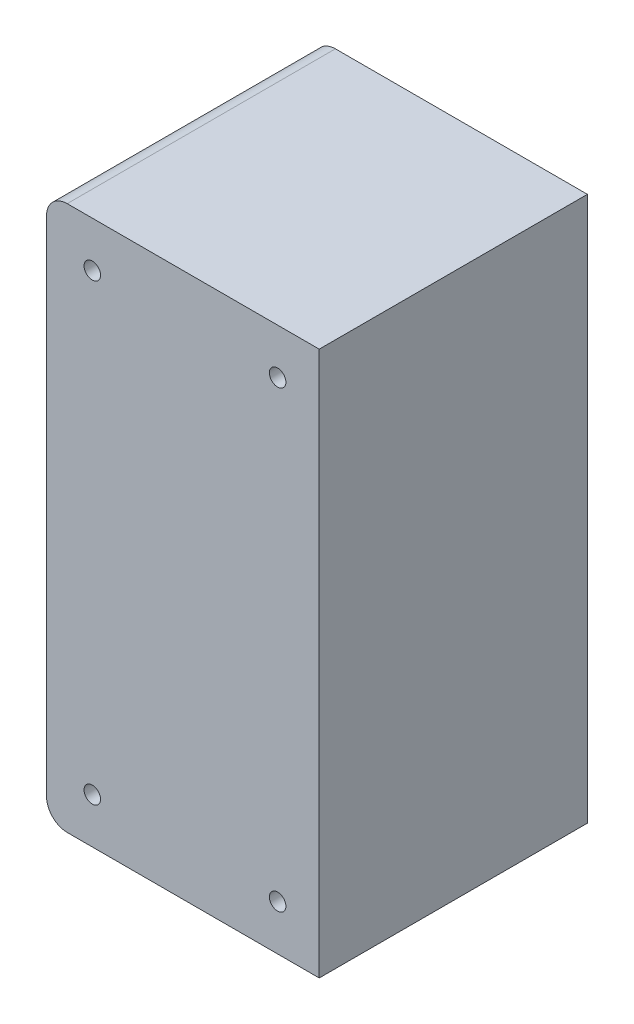
ISO-10303-21;
HEADER;
FILE_DESCRIPTION(('STEP AP214'),'2;1');
FILE_NAME('part.step','',(''),(''),'','','');
FILE_SCHEMA(('AUTOMOTIVE_DESIGN { 1 0 10303 214 1 1 1 1 }'));
ENDSEC;
DATA;
#1=APPLICATION_CONTEXT('core data for automotive mechanical design processes');
#2=APPLICATION_PROTOCOL_DEFINITION('international standard','automotive_design',2000,#1);
#3=PRODUCT_CONTEXT('',#1,'mechanical');
#4=PRODUCT('Part','Part','',(#3));
#5=PRODUCT_RELATED_PRODUCT_CATEGORY('part','',(#4));
#6=PRODUCT_DEFINITION_FORMATION('','',#4);
#7=PRODUCT_DEFINITION_CONTEXT('part definition',#1,'design');
#8=PRODUCT_DEFINITION('design','',#6,#7);
#9=PRODUCT_DEFINITION_SHAPE('','',#8);
#10=(LENGTH_UNIT() NAMED_UNIT(*) SI_UNIT(.MILLI.,.METRE.));
#11=(NAMED_UNIT(*) PLANE_ANGLE_UNIT() SI_UNIT($,.RADIAN.));
#12=(NAMED_UNIT(*) SI_UNIT($,.STERADIAN.) SOLID_ANGLE_UNIT());
#13=UNCERTAINTY_MEASURE_WITH_UNIT(LENGTH_MEASURE(1.E-05),#10,'distance_accuracy_value','');
#14=(GEOMETRIC_REPRESENTATION_CONTEXT(3) GLOBAL_UNCERTAINTY_ASSIGNED_CONTEXT((#13)) GLOBAL_UNIT_ASSIGNED_CONTEXT((#10,
#11,#12)) REPRESENTATION_CONTEXT('',''));
#15=CARTESIAN_POINT('',(0.,0.,0.));
#16=DIRECTION('',(0.,0.,1.));
#17=DIRECTION('',(1.,0.,0.));
#18=AXIS2_PLACEMENT_3D('',#15,#16,#17);
#19=CARTESIAN_POINT('',(22.958,-55.,65.));
#20=DIRECTION('',(0.,0.,-1.));
#21=DIRECTION('',(-1.,0.,0.));
#22=AXIS2_PLACEMENT_3D('',#19,#20,#21);
#23=CYLINDRICAL_SURFACE('',#22,2.);
#24=CARTESIAN_POINT('',(22.958,-55.,65.));
#25=DIRECTION('',(0.,0.,1.));
#26=DIRECTION('',(1.,0.,0.));
#27=AXIS2_PLACEMENT_3D('',#24,#25,#26);
#28=CIRCLE('',#27,2.);
#29=CARTESIAN_POINT('',(24.958,-55.,65.));
#30=VERTEX_POINT('',#29);
#31=EDGE_CURVE('E136',#30,#30,#28,.T.);
#32=ORIENTED_EDGE('',*,*,#31,.T.);
#33=EDGE_LOOP('',(#32));
#34=FACE_BOUND('',#33,.T.);
#35=CARTESIAN_POINT('',(22.958,-55.,61.));
#36=DIRECTION('',(0.,0.,-1.));
#37=DIRECTION('',(-1.,0.,0.));
#38=AXIS2_PLACEMENT_3D('',#35,#36,#37);
#39=CIRCLE('',#38,2.);
#40=CARTESIAN_POINT('',(20.958,-55.,61.));
#41=VERTEX_POINT('',#40);
#42=EDGE_CURVE('E190',#41,#41,#39,.T.);
#43=ORIENTED_EDGE('',*,*,#42,.T.);
#44=EDGE_LOOP('',(#43));
#45=FACE_BOUND('',#44,.T.);
#46=ADVANCED_FACE('F34',(#34,#45),#23,.F.);
#47=CARTESIAN_POINT('',(-21.958,55.,65.));
#48=DIRECTION('',(0.,0.,-1.));
#49=DIRECTION('',(-1.,0.,0.));
#50=AXIS2_PLACEMENT_3D('',#47,#48,#49);
#51=CYLINDRICAL_SURFACE('',#50,1.99999999999998);
#52=CARTESIAN_POINT('',(-21.958,55.,65.));
#53=DIRECTION('',(0.,0.,1.));
#54=DIRECTION('',(1.,0.,0.));
#55=AXIS2_PLACEMENT_3D('',#52,#53,#54);
#56=CIRCLE('',#55,1.99999999999998);
#57=CARTESIAN_POINT('',(-19.958,55.,65.));
#58=VERTEX_POINT('',#57);
#59=EDGE_CURVE('E163',#58,#58,#56,.T.);
#60=ORIENTED_EDGE('',*,*,#59,.T.);
#61=EDGE_LOOP('',(#60));
#62=FACE_BOUND('',#61,.T.);
#63=CARTESIAN_POINT('',(-21.958,55.,61.));
#64=DIRECTION('',(0.,0.,-1.));
#65=DIRECTION('',(-1.,0.,0.));
#66=AXIS2_PLACEMENT_3D('',#63,#64,#65);
#67=CIRCLE('',#66,1.99999999999998);
#68=CARTESIAN_POINT('',(-23.958,55.,61.));
#69=VERTEX_POINT('',#68);
#70=EDGE_CURVE('E225',#69,#69,#67,.T.);
#71=ORIENTED_EDGE('',*,*,#70,.T.);
#72=EDGE_LOOP('',(#71));
#73=FACE_BOUND('',#72,.T.);
#74=ADVANCED_FACE('F250',(#62,#73),#51,.F.);
#75=CARTESIAN_POINT('',(-21.958,-55.,65.));
#76=DIRECTION('',(0.,0.,-1.));
#77=DIRECTION('',(-1.,0.,0.));
#78=AXIS2_PLACEMENT_3D('',#75,#76,#77);
#79=CYLINDRICAL_SURFACE('',#78,1.99999999999998);
#80=CARTESIAN_POINT('',(-21.958,-55.,65.));
#81=DIRECTION('',(0.,0.,1.));
#82=DIRECTION('',(1.,0.,0.));
#83=AXIS2_PLACEMENT_3D('',#80,#81,#82);
#84=CIRCLE('',#83,1.99999999999998);
#85=CARTESIAN_POINT('',(-19.958,-55.,65.));
#86=VERTEX_POINT('',#85);
#87=EDGE_CURVE('E166',#86,#86,#84,.T.);
#88=ORIENTED_EDGE('',*,*,#87,.T.);
#89=EDGE_LOOP('',(#88));
#90=FACE_BOUND('',#89,.T.);
#91=CARTESIAN_POINT('',(-21.958,-55.,61.));
#92=DIRECTION('',(0.,0.,-1.));
#93=DIRECTION('',(-1.,0.,0.));
#94=AXIS2_PLACEMENT_3D('',#91,#92,#93);
#95=CIRCLE('',#94,1.99999999999998);
#96=CARTESIAN_POINT('',(-23.958,-55.,61.));
#97=VERTEX_POINT('',#96);
#98=EDGE_CURVE('E228',#97,#97,#95,.T.);
#99=ORIENTED_EDGE('',*,*,#98,.T.);
#100=EDGE_LOOP('',(#99));
#101=FACE_BOUND('',#100,.T.);
#102=ADVANCED_FACE('F256',(#90,#101),#79,.F.);
#103=CARTESIAN_POINT('',(22.958,55.,65.));
#104=DIRECTION('',(0.,0.,-1.));
#105=DIRECTION('',(-1.,0.,0.));
#106=AXIS2_PLACEMENT_3D('',#103,#104,#105);
#107=CYLINDRICAL_SURFACE('',#106,2.);
#108=CARTESIAN_POINT('',(22.958,55.,65.));
#109=DIRECTION('',(0.,0.,1.));
#110=DIRECTION('',(1.,0.,0.));
#111=AXIS2_PLACEMENT_3D('',#108,#109,#110);
#112=CIRCLE('',#111,2.);
#113=CARTESIAN_POINT('',(24.958,55.,65.));
#114=VERTEX_POINT('',#113);
#115=EDGE_CURVE('E169',#114,#114,#112,.T.);
#116=ORIENTED_EDGE('',*,*,#115,.T.);
#117=EDGE_LOOP('',(#116));
#118=FACE_BOUND('',#117,.T.);
#119=CARTESIAN_POINT('',(22.958,55.,61.));
#120=DIRECTION('',(0.,0.,-1.));
#121=DIRECTION('',(-1.,0.,0.));
#122=AXIS2_PLACEMENT_3D('',#119,#120,#121);
#123=CIRCLE('',#122,2.);
#124=CARTESIAN_POINT('',(20.958,55.,61.));
#125=VERTEX_POINT('',#124);
#126=EDGE_CURVE('E231',#125,#125,#123,.T.);
#127=ORIENTED_EDGE('',*,*,#126,.T.);
#128=EDGE_LOOP('',(#127));
#129=FACE_BOUND('',#128,.T.);
#130=ADVANCED_FACE('F235',(#118,#129),#107,.F.);
#131=CARTESIAN_POINT('',(-28.042,61.,65.));
#132=DIRECTION('',(0.,0.,1.));
#133=DIRECTION('',(1.,0.,0.));
#134=AXIS2_PLACEMENT_3D('',#131,#132,#133);
#135=PLANE('',#134);
#136=ORIENTED_EDGE('',*,*,#87,.F.);
#137=EDGE_LOOP('',(#136));
#138=FACE_BOUND('',#137,.T.);
#139=ORIENTED_EDGE('',*,*,#31,.F.);
#140=EDGE_LOOP('',(#139));
#141=FACE_BOUND('',#140,.T.);
#142=CARTESIAN_POINT('',(-28.042,61.,65.));
#143=DIRECTION('',(0.,0.,1.));
#144=DIRECTION('',(1.,0.,0.));
#145=AXIS2_PLACEMENT_3D('',#142,#143,#144);
#146=CIRCLE('',#145,5.);
#147=CARTESIAN_POINT('',(-28.042,66.,65.));
#148=VERTEX_POINT('',#147);
#149=CARTESIAN_POINT('',(-33.042,61.,65.));
#150=VERTEX_POINT('',#149);
#151=EDGE_CURVE('E144',#148,#150,#146,.T.);
#152=ORIENTED_EDGE('',*,*,#151,.T.);
#153=DIRECTION('',(0.,-1.,0.));
#154=VECTOR('',#153,1.);
#155=CARTESIAN_POINT('',(-33.042,61.,65.));
#156=LINE('',#155,#154);
#157=CARTESIAN_POINT('',(-33.042,-61.,65.));
#158=VERTEX_POINT('',#157);
#159=EDGE_CURVE('E93',#150,#158,#156,.T.);
#160=ORIENTED_EDGE('',*,*,#159,.T.);
#161=CARTESIAN_POINT('',(-28.042,-61.,65.));
#162=DIRECTION('',(0.,0.,1.));
#163=DIRECTION('',(1.,0.,0.));
#164=AXIS2_PLACEMENT_3D('',#161,#162,#163);
#165=CIRCLE('',#164,5.);
#166=CARTESIAN_POINT('',(-28.042,-66.,65.));
#167=VERTEX_POINT('',#166);
#168=EDGE_CURVE('E111',#158,#167,#165,.T.);
#169=ORIENTED_EDGE('',*,*,#168,.T.);
#170=DIRECTION('',(1.,0.,0.));
#171=VECTOR('',#170,1.);
#172=CARTESIAN_POINT('',(-28.042,-66.,65.));
#173=LINE('',#172,#171);
#174=CARTESIAN_POINT('',(33.042,-66.,65.));
#175=VERTEX_POINT('',#174);
#176=EDGE_CURVE('E103',#167,#175,#173,.T.);
#177=ORIENTED_EDGE('',*,*,#176,.T.);
#178=DIRECTION('',(0.,1.,0.));
#179=VECTOR('',#178,1.);
#180=CARTESIAN_POINT('',(33.042,-66.,65.));
#181=LINE('',#180,#179);
#182=CARTESIAN_POINT('',(33.042,66.,65.));
#183=VERTEX_POINT('',#182);
#184=EDGE_CURVE('E108',#175,#183,#181,.T.);
#185=ORIENTED_EDGE('',*,*,#184,.T.);
#186=DIRECTION('',(-1.,0.,0.));
#187=VECTOR('',#186,1.);
#188=CARTESIAN_POINT('',(33.042,66.,65.));
#189=LINE('',#188,#187);
#190=EDGE_CURVE('E58',#183,#148,#189,.T.);
#191=ORIENTED_EDGE('',*,*,#190,.T.);
#192=EDGE_LOOP('',(#152,#160,#169,#177,#185,#191));
#193=FACE_BOUND('',#192,.T.);
#194=ORIENTED_EDGE('',*,*,#59,.F.);
#195=EDGE_LOOP('',(#194));
#196=FACE_BOUND('',#195,.T.);
#197=ORIENTED_EDGE('',*,*,#115,.F.);
#198=EDGE_LOOP('',(#197));
#199=FACE_BOUND('',#198,.T.);
#200=ADVANCED_FACE('F105',(#138,#141,#193,#196,#199),#135,.T.);
#201=CARTESIAN_POINT('',(-28.042,61.,0.));
#202=DIRECTION('',(0.,0.,1.));
#203=DIRECTION('',(1.,0.,0.));
#204=AXIS2_PLACEMENT_3D('',#201,#202,#203);
#205=PLANE('',#204);
#206=DIRECTION('',(-1.,0.,0.));
#207=VECTOR('',#206,1.);
#208=CARTESIAN_POINT('',(33.042,62.,0.));
#209=LINE('',#208,#207);
#210=CARTESIAN_POINT('',(29.042,62.,0.));
#211=VERTEX_POINT('',#210);
#212=CARTESIAN_POINT('',(-28.042,62.,0.));
#213=VERTEX_POINT('',#212);
#214=EDGE_CURVE('E184',#211,#213,#209,.T.);
#215=ORIENTED_EDGE('',*,*,#214,.T.);
#216=CARTESIAN_POINT('',(-28.042,61.,0.));
#217=DIRECTION('',(0.,0.,1.));
#218=DIRECTION('',(1.,0.,0.));
#219=AXIS2_PLACEMENT_3D('',#216,#217,#218);
#220=CIRCLE('',#219,1.);
#221=CARTESIAN_POINT('',(-29.042,61.,0.));
#222=VERTEX_POINT('',#221);
#223=EDGE_CURVE('E176',#213,#222,#220,.T.);
#224=ORIENTED_EDGE('',*,*,#223,.T.);
#225=DIRECTION('',(0.,-1.,0.));
#226=VECTOR('',#225,1.);
#227=CARTESIAN_POINT('',(-29.042,61.,0.));
#228=LINE('',#227,#226);
#229=CARTESIAN_POINT('',(-29.042,-61.,0.));
#230=VERTEX_POINT('',#229);
#231=EDGE_CURVE('E173',#222,#230,#228,.T.);
#232=ORIENTED_EDGE('',*,*,#231,.T.);
#233=CARTESIAN_POINT('',(-28.042,-61.,0.));
#234=DIRECTION('',(0.,0.,1.));
#235=DIRECTION('',(1.,0.,0.));
#236=AXIS2_PLACEMENT_3D('',#233,#234,#235);
#237=CIRCLE('',#236,1.);
#238=CARTESIAN_POINT('',(-28.042,-62.,0.));
#239=VERTEX_POINT('',#238);
#240=EDGE_CURVE('E49',#230,#239,#237,.T.);
#241=ORIENTED_EDGE('',*,*,#240,.T.);
#242=DIRECTION('',(1.,0.,0.));
#243=VECTOR('',#242,1.);
#244=CARTESIAN_POINT('',(-28.042,-62.,0.));
#245=LINE('',#244,#243);
#246=CARTESIAN_POINT('',(29.042,-62.,0.));
#247=VERTEX_POINT('',#246);
#248=EDGE_CURVE('E178',#239,#247,#245,.T.);
#249=ORIENTED_EDGE('',*,*,#248,.T.);
#250=DIRECTION('',(0.,1.,0.));
#251=VECTOR('',#250,1.);
#252=CARTESIAN_POINT('',(29.042,-66.,0.));
#253=LINE('',#252,#251);
#254=EDGE_CURVE('E181',#247,#211,#253,.T.);
#255=ORIENTED_EDGE('',*,*,#254,.T.);
#256=EDGE_LOOP('',(#215,#224,#232,#241,#249,#255));
#257=FACE_BOUND('',#256,.T.);
#258=CARTESIAN_POINT('',(-28.042,61.,0.));
#259=DIRECTION('',(0.,0.,1.));
#260=DIRECTION('',(1.,0.,0.));
#261=AXIS2_PLACEMENT_3D('',#258,#259,#260);
#262=CIRCLE('',#261,5.);
#263=CARTESIAN_POINT('',(-28.042,66.,0.));
#264=VERTEX_POINT('',#263);
#265=CARTESIAN_POINT('',(-33.042,61.,0.));
#266=VERTEX_POINT('',#265);
#267=EDGE_CURVE('E132',#264,#266,#262,.T.);
#268=ORIENTED_EDGE('',*,*,#267,.F.);
#269=DIRECTION('',(-1.,0.,0.));
#270=VECTOR('',#269,1.);
#271=CARTESIAN_POINT('',(33.042,66.,0.));
#272=LINE('',#271,#270);
#273=CARTESIAN_POINT('',(33.042,66.,0.));
#274=VERTEX_POINT('',#273);
#275=EDGE_CURVE('E85',#274,#264,#272,.T.);
#276=ORIENTED_EDGE('',*,*,#275,.F.);
#277=DIRECTION('',(0.,1.,0.));
#278=VECTOR('',#277,1.);
#279=CARTESIAN_POINT('',(33.042,-66.,0.));
#280=LINE('',#279,#278);
#281=CARTESIAN_POINT('',(33.042,-66.,0.));
#282=VERTEX_POINT('',#281);
#283=EDGE_CURVE('E141',#282,#274,#280,.T.);
#284=ORIENTED_EDGE('',*,*,#283,.F.);
#285=DIRECTION('',(1.,0.,0.));
#286=VECTOR('',#285,1.);
#287=CARTESIAN_POINT('',(-28.042,-66.,0.));
#288=LINE('',#287,#286);
#289=CARTESIAN_POINT('',(-28.042,-66.,0.));
#290=VERTEX_POINT('',#289);
#291=EDGE_CURVE('E120',#290,#282,#288,.T.);
#292=ORIENTED_EDGE('',*,*,#291,.F.);
#293=CARTESIAN_POINT('',(-28.042,-61.,0.));
#294=DIRECTION('',(0.,0.,1.));
#295=DIRECTION('',(1.,0.,0.));
#296=AXIS2_PLACEMENT_3D('',#293,#294,#295);
#297=CIRCLE('',#296,5.);
#298=CARTESIAN_POINT('',(-33.042,-61.,0.));
#299=VERTEX_POINT('',#298);
#300=EDGE_CURVE('E138',#299,#290,#297,.T.);
#301=ORIENTED_EDGE('',*,*,#300,.F.);
#302=DIRECTION('',(0.,-1.,0.));
#303=VECTOR('',#302,1.);
#304=CARTESIAN_POINT('',(-33.042,61.,0.));
#305=LINE('',#304,#303);
#306=EDGE_CURVE('E135',#266,#299,#305,.T.);
#307=ORIENTED_EDGE('',*,*,#306,.F.);
#308=EDGE_LOOP('',(#268,#276,#284,#292,#301,#307));
#309=FACE_BOUND('',#308,.T.);
#310=ADVANCED_FACE('F153',(#257,#309),#205,.F.);
#311=CARTESIAN_POINT('',(-28.042,61.,65.));
#312=DIRECTION('',(0.,0.,-1.));
#313=DIRECTION('',(-1.,0.,0.));
#314=AXIS2_PLACEMENT_3D('',#311,#312,#313);
#315=CYLINDRICAL_SURFACE('',#314,5.);
#316=ORIENTED_EDGE('',*,*,#267,.T.);
#317=DIRECTION('',(0.,0.,-1.));
#318=VECTOR('',#317,1.);
#319=CARTESIAN_POINT('',(-33.042,61.,65.));
#320=LINE('',#319,#318);
#321=EDGE_CURVE('E11',#150,#266,#320,.T.);
#322=ORIENTED_EDGE('',*,*,#321,.F.);
#323=ORIENTED_EDGE('',*,*,#151,.F.);
#324=DIRECTION('',(0.,0.,-1.));
#325=VECTOR('',#324,1.);
#326=CARTESIAN_POINT('',(-28.042,66.,65.));
#327=LINE('',#326,#325);
#328=EDGE_CURVE('E128',#148,#264,#327,.T.);
#329=ORIENTED_EDGE('',*,*,#328,.T.);
#330=EDGE_LOOP('',(#316,#322,#323,#329));
#331=FACE_BOUND('',#330,.T.);
#332=ADVANCED_FACE('F36',(#331),#315,.T.);
#333=CARTESIAN_POINT('',(-33.042,61.,65.));
#334=DIRECTION('',(1.,0.,0.));
#335=DIRECTION('',(0.,0.,-1.));
#336=AXIS2_PLACEMENT_3D('',#333,#334,#335);
#337=PLANE('',#336);
#338=ORIENTED_EDGE('',*,*,#306,.T.);
#339=DIRECTION('',(0.,0.,-1.));
#340=VECTOR('',#339,1.);
#341=CARTESIAN_POINT('',(-33.042,-61.,65.));
#342=LINE('',#341,#340);
#343=EDGE_CURVE('E42',#158,#299,#342,.T.);
#344=ORIENTED_EDGE('',*,*,#343,.F.);
#345=ORIENTED_EDGE('',*,*,#159,.F.);
#346=ORIENTED_EDGE('',*,*,#321,.T.);
#347=EDGE_LOOP('',(#338,#344,#345,#346));
#348=FACE_BOUND('',#347,.T.);
#349=ADVANCED_FACE('F274',(#348),#337,.F.);
#350=CARTESIAN_POINT('',(-28.042,-61.,65.));
#351=DIRECTION('',(0.,0.,-1.));
#352=DIRECTION('',(-1.,0.,0.));
#353=AXIS2_PLACEMENT_3D('',#350,#351,#352);
#354=CYLINDRICAL_SURFACE('',#353,5.);
#355=ORIENTED_EDGE('',*,*,#300,.T.);
#356=DIRECTION('',(0.,0.,-1.));
#357=VECTOR('',#356,1.);
#358=CARTESIAN_POINT('',(-28.042,-66.,65.));
#359=LINE('',#358,#357);
#360=EDGE_CURVE('E123',#167,#290,#359,.T.);
#361=ORIENTED_EDGE('',*,*,#360,.F.);
#362=ORIENTED_EDGE('',*,*,#168,.F.);
#363=ORIENTED_EDGE('',*,*,#343,.T.);
#364=EDGE_LOOP('',(#355,#361,#362,#363));
#365=FACE_BOUND('',#364,.T.);
#366=ADVANCED_FACE('F150',(#365),#354,.T.);
#367=CARTESIAN_POINT('',(-28.042,-66.,65.));
#368=DIRECTION('',(0.,1.,0.));
#369=DIRECTION('',(0.,0.,1.));
#370=AXIS2_PLACEMENT_3D('',#367,#368,#369);
#371=PLANE('',#370);
#372=ORIENTED_EDGE('',*,*,#291,.T.);
#373=DIRECTION('',(0.,0.,-1.));
#374=VECTOR('',#373,1.);
#375=CARTESIAN_POINT('',(33.042,-66.,65.));
#376=LINE('',#375,#374);
#377=EDGE_CURVE('E117',#175,#282,#376,.T.);
#378=ORIENTED_EDGE('',*,*,#377,.F.);
#379=ORIENTED_EDGE('',*,*,#176,.F.);
#380=ORIENTED_EDGE('',*,*,#360,.T.);
#381=EDGE_LOOP('',(#372,#378,#379,#380));
#382=FACE_BOUND('',#381,.T.);
#383=ADVANCED_FACE('F118',(#382),#371,.F.);
#384=CARTESIAN_POINT('',(33.042,-66.,65.));
#385=DIRECTION('',(-1.,0.,0.));
#386=DIRECTION('',(0.,0.,1.));
#387=AXIS2_PLACEMENT_3D('',#384,#385,#386);
#388=PLANE('',#387);
#389=ORIENTED_EDGE('',*,*,#283,.T.);
#390=DIRECTION('',(0.,0.,-1.));
#391=VECTOR('',#390,1.);
#392=CARTESIAN_POINT('',(33.042,66.,65.));
#393=LINE('',#392,#391);
#394=EDGE_CURVE('E124',#183,#274,#393,.T.);
#395=ORIENTED_EDGE('',*,*,#394,.F.);
#396=ORIENTED_EDGE('',*,*,#184,.F.);
#397=ORIENTED_EDGE('',*,*,#377,.T.);
#398=EDGE_LOOP('',(#389,#395,#396,#397));
#399=FACE_BOUND('',#398,.T.);
#400=ADVANCED_FACE('F126',(#399),#388,.F.);
#401=CARTESIAN_POINT('',(33.042,66.,65.));
#402=DIRECTION('',(0.,-1.,0.));
#403=DIRECTION('',(0.,0.,-1.));
#404=AXIS2_PLACEMENT_3D('',#401,#402,#403);
#405=PLANE('',#404);
#406=ORIENTED_EDGE('',*,*,#275,.T.);
#407=ORIENTED_EDGE('',*,*,#328,.F.);
#408=ORIENTED_EDGE('',*,*,#190,.F.);
#409=ORIENTED_EDGE('',*,*,#394,.T.);
#410=EDGE_LOOP('',(#406,#407,#408,#409));
#411=FACE_BOUND('',#410,.T.);
#412=ADVANCED_FACE('F154',(#411),#405,.F.);
#413=CARTESIAN_POINT('',(-28.042,61.,61.));
#414=DIRECTION('',(0.,0.,1.));
#415=DIRECTION('',(1.,0.,0.));
#416=AXIS2_PLACEMENT_3D('',#413,#414,#415);
#417=PLANE('',#416);
#418=CARTESIAN_POINT('',(-28.042,61.,61.));
#419=DIRECTION('',(0.,0.,1.));
#420=DIRECTION('',(1.,0.,0.));
#421=AXIS2_PLACEMENT_3D('',#418,#419,#420);
#422=CIRCLE('',#421,1.);
#423=CARTESIAN_POINT('',(-28.042,62.,61.));
#424=VERTEX_POINT('',#423);
#425=CARTESIAN_POINT('',(-29.042,61.,61.));
#426=VERTEX_POINT('',#425);
#427=EDGE_CURVE('E187',#424,#426,#422,.T.);
#428=ORIENTED_EDGE('',*,*,#427,.F.);
#429=DIRECTION('',(-1.,0.,0.));
#430=VECTOR('',#429,1.);
#431=CARTESIAN_POINT('',(33.042,62.,61.));
#432=LINE('',#431,#430);
#433=CARTESIAN_POINT('',(29.042,62.,61.));
#434=VERTEX_POINT('',#433);
#435=EDGE_CURVE('E204',#434,#424,#432,.T.);
#436=ORIENTED_EDGE('',*,*,#435,.F.);
#437=DIRECTION('',(0.,1.,0.));
#438=VECTOR('',#437,1.);
#439=CARTESIAN_POINT('',(29.042,-66.,61.));
#440=LINE('',#439,#438);
#441=CARTESIAN_POINT('',(29.042,-62.,61.));
#442=VERTEX_POINT('',#441);
#443=EDGE_CURVE('E209',#442,#434,#440,.T.);
#444=ORIENTED_EDGE('',*,*,#443,.F.);
#445=DIRECTION('',(1.,0.,0.));
#446=VECTOR('',#445,1.);
#447=CARTESIAN_POINT('',(-28.042,-62.,61.));
#448=LINE('',#447,#446);
#449=CARTESIAN_POINT('',(-28.042,-62.,61.));
#450=VERTEX_POINT('',#449);
#451=EDGE_CURVE('E212',#450,#442,#448,.T.);
#452=ORIENTED_EDGE('',*,*,#451,.F.);
#453=CARTESIAN_POINT('',(-28.042,-61.,61.));
#454=DIRECTION('',(0.,0.,1.));
#455=DIRECTION('',(1.,0.,0.));
#456=AXIS2_PLACEMENT_3D('',#453,#454,#455);
#457=CIRCLE('',#456,1.);
#458=CARTESIAN_POINT('',(-29.042,-61.,61.));
#459=VERTEX_POINT('',#458);
#460=EDGE_CURVE('E215',#459,#450,#457,.T.);
#461=ORIENTED_EDGE('',*,*,#460,.F.);
#462=DIRECTION('',(0.,-1.,0.));
#463=VECTOR('',#462,1.);
#464=CARTESIAN_POINT('',(-29.042,61.,61.));
#465=LINE('',#464,#463);
#466=EDGE_CURVE('E218',#426,#459,#465,.T.);
#467=ORIENTED_EDGE('',*,*,#466,.F.);
#468=EDGE_LOOP('',(#428,#436,#444,#452,#461,#467));
#469=FACE_BOUND('',#468,.T.);
#470=ORIENTED_EDGE('',*,*,#126,.F.);
#471=EDGE_LOOP('',(#470));
#472=FACE_BOUND('',#471,.T.);
#473=ORIENTED_EDGE('',*,*,#98,.F.);
#474=EDGE_LOOP('',(#473));
#475=FACE_BOUND('',#474,.T.);
#476=ORIENTED_EDGE('',*,*,#70,.F.);
#477=EDGE_LOOP('',(#476));
#478=FACE_BOUND('',#477,.T.);
#479=ORIENTED_EDGE('',*,*,#42,.F.);
#480=EDGE_LOOP('',(#479));
#481=FACE_BOUND('',#480,.T.);
#482=ADVANCED_FACE('F237',(#469,#472,#475,#478,#481),#417,.F.);
#483=CARTESIAN_POINT('',(-28.042,61.,65.));
#484=DIRECTION('',(0.,0.,-1.));
#485=DIRECTION('',(-1.,0.,0.));
#486=AXIS2_PLACEMENT_3D('',#483,#484,#485);
#487=CYLINDRICAL_SURFACE('',#486,1.);
#488=ORIENTED_EDGE('',*,*,#223,.F.);
#489=DIRECTION('',(0.,0.,-1.));
#490=VECTOR('',#489,1.);
#491=CARTESIAN_POINT('',(-28.042,62.,65.));
#492=LINE('',#491,#490);
#493=EDGE_CURVE('E195',#424,#213,#492,.T.);
#494=ORIENTED_EDGE('',*,*,#493,.F.);
#495=ORIENTED_EDGE('',*,*,#427,.T.);
#496=DIRECTION('',(0.,0.,-1.));
#497=VECTOR('',#496,1.);
#498=CARTESIAN_POINT('',(-29.042,61.,65.));
#499=LINE('',#498,#497);
#500=EDGE_CURVE('E172',#426,#222,#499,.T.);
#501=ORIENTED_EDGE('',*,*,#500,.T.);
#502=EDGE_LOOP('',(#488,#494,#495,#501));
#503=FACE_BOUND('',#502,.T.);
#504=ADVANCED_FACE('F240',(#503),#487,.F.);
#505=CARTESIAN_POINT('',(-29.042,61.,65.));
#506=DIRECTION('',(1.,0.,0.));
#507=DIRECTION('',(0.,0.,-1.));
#508=AXIS2_PLACEMENT_3D('',#505,#506,#507);
#509=PLANE('',#508);
#510=ORIENTED_EDGE('',*,*,#231,.F.);
#511=ORIENTED_EDGE('',*,*,#500,.F.);
#512=ORIENTED_EDGE('',*,*,#466,.T.);
#513=DIRECTION('',(0.,0.,-1.));
#514=VECTOR('',#513,1.);
#515=CARTESIAN_POINT('',(-29.042,-61.,65.));
#516=LINE('',#515,#514);
#517=EDGE_CURVE('E200',#459,#230,#516,.T.);
#518=ORIENTED_EDGE('',*,*,#517,.T.);
#519=EDGE_LOOP('',(#510,#511,#512,#518));
#520=FACE_BOUND('',#519,.T.);
#521=ADVANCED_FACE('F355',(#520),#509,.T.);
#522=CARTESIAN_POINT('',(-28.042,-61.,65.));
#523=DIRECTION('',(0.,0.,-1.));
#524=DIRECTION('',(-1.,0.,0.));
#525=AXIS2_PLACEMENT_3D('',#522,#523,#524);
#526=CYLINDRICAL_SURFACE('',#525,1.);
#527=ORIENTED_EDGE('',*,*,#240,.F.);
#528=ORIENTED_EDGE('',*,*,#517,.F.);
#529=ORIENTED_EDGE('',*,*,#460,.T.);
#530=DIRECTION('',(0.,0.,1.));
#531=VECTOR('',#530,1.);
#532=CARTESIAN_POINT('',(-28.042,-62.,65.));
#533=LINE('',#532,#531);
#534=EDGE_CURVE('E198',#450,#239,#533,.F.);
#535=ORIENTED_EDGE('',*,*,#534,.T.);
#536=EDGE_LOOP('',(#527,#528,#529,#535));
#537=FACE_BOUND('',#536,.T.);
#538=ADVANCED_FACE('F345',(#537),#526,.F.);
#539=CARTESIAN_POINT('',(-28.042,-62.,65.));
#540=DIRECTION('',(0.,1.,0.));
#541=DIRECTION('',(0.,0.,1.));
#542=AXIS2_PLACEMENT_3D('',#539,#540,#541);
#543=PLANE('',#542);
#544=ORIENTED_EDGE('',*,*,#248,.F.);
#545=ORIENTED_EDGE('',*,*,#534,.F.);
#546=ORIENTED_EDGE('',*,*,#451,.T.);
#547=DIRECTION('',(0.,0.,-1.));
#548=VECTOR('',#547,1.);
#549=CARTESIAN_POINT('',(29.042,-62.,65.));
#550=LINE('',#549,#548);
#551=EDGE_CURVE('E194',#442,#247,#550,.T.);
#552=ORIENTED_EDGE('',*,*,#551,.T.);
#553=EDGE_LOOP('',(#544,#545,#546,#552));
#554=FACE_BOUND('',#553,.T.);
#555=ADVANCED_FACE('F335',(#554),#543,.T.);
#556=CARTESIAN_POINT('',(29.042,-66.,65.));
#557=DIRECTION('',(-1.,0.,0.));
#558=DIRECTION('',(0.,0.,1.));
#559=AXIS2_PLACEMENT_3D('',#556,#557,#558);
#560=PLANE('',#559);
#561=ORIENTED_EDGE('',*,*,#254,.F.);
#562=ORIENTED_EDGE('',*,*,#551,.F.);
#563=ORIENTED_EDGE('',*,*,#443,.T.);
#564=DIRECTION('',(0.,0.,-1.));
#565=VECTOR('',#564,1.);
#566=CARTESIAN_POINT('',(29.042,62.,65.));
#567=LINE('',#566,#565);
#568=EDGE_CURVE('E191',#434,#211,#567,.T.);
#569=ORIENTED_EDGE('',*,*,#568,.T.);
#570=EDGE_LOOP('',(#561,#562,#563,#569));
#571=FACE_BOUND('',#570,.T.);
#572=ADVANCED_FACE('F325',(#571),#560,.T.);
#573=CARTESIAN_POINT('',(33.042,62.,65.));
#574=DIRECTION('',(0.,-1.,0.));
#575=DIRECTION('',(0.,0.,-1.));
#576=AXIS2_PLACEMENT_3D('',#573,#574,#575);
#577=PLANE('',#576);
#578=ORIENTED_EDGE('',*,*,#214,.F.);
#579=ORIENTED_EDGE('',*,*,#568,.F.);
#580=ORIENTED_EDGE('',*,*,#435,.T.);
#581=ORIENTED_EDGE('',*,*,#493,.T.);
#582=EDGE_LOOP('',(#578,#579,#580,#581));
#583=FACE_BOUND('',#582,.T.);
#584=ADVANCED_FACE('F320',(#583),#577,.T.);
#585=CLOSED_SHELL('',(#46,#74,#102,#130,#200,#310,#332,#349,#366,#383,#400,#412,#482,#504,#521,
#538,#555,#572,#584));
#586=MANIFOLD_SOLID_BREP('B2',#585);
#587=ADVANCED_BREP_SHAPE_REPRESENTATION('',(#18,#586),#14);
#588=SHAPE_DEFINITION_REPRESENTATION(#9,#587);
ENDSEC;
END-ISO-10303-21;
